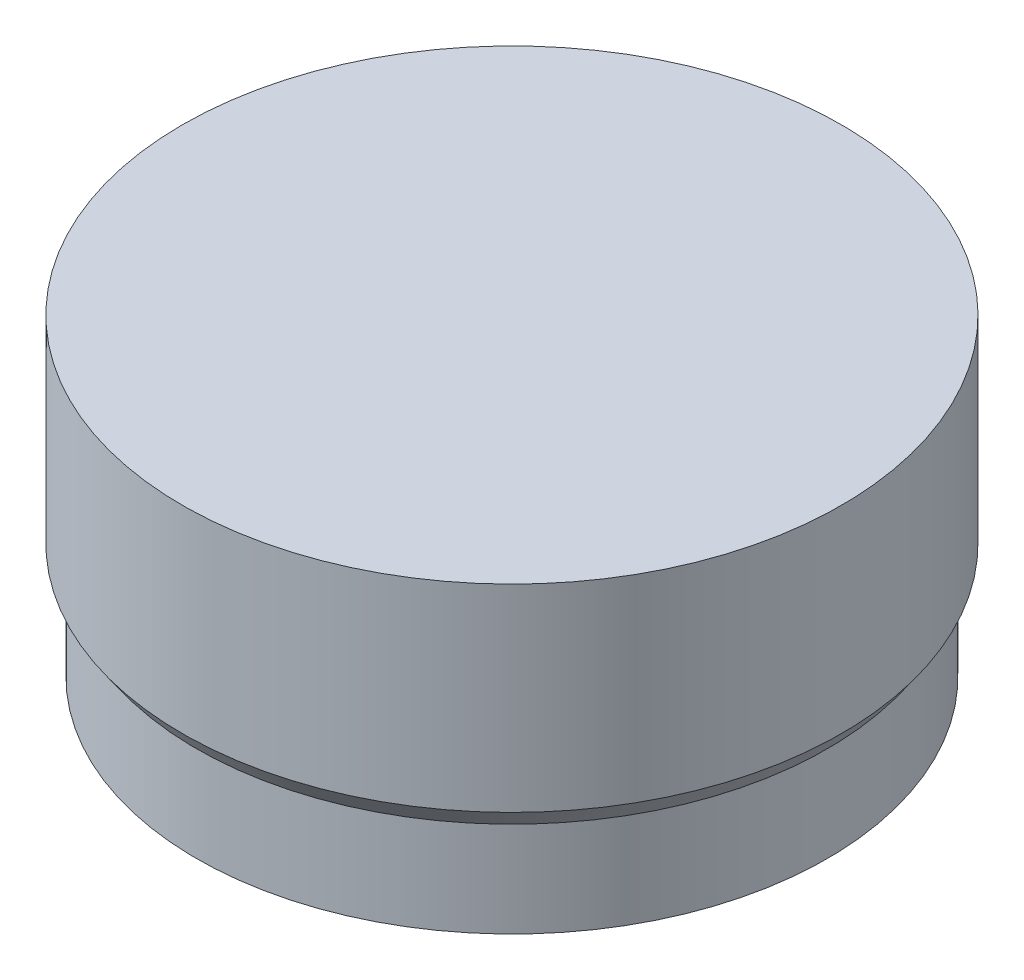
ISO-10303-21;
HEADER;
FILE_DESCRIPTION(('STEP AP214'),'2;1');
FILE_NAME('part.step','',(''),(''),'','','');
FILE_SCHEMA(('AUTOMOTIVE_DESIGN { 1 0 10303 214 1 1 1 1 }'));
ENDSEC;
DATA;
#1=APPLICATION_CONTEXT('core data for automotive mechanical design processes');
#2=APPLICATION_PROTOCOL_DEFINITION('international standard','automotive_design',2000,#1);
#3=PRODUCT_CONTEXT('',#1,'mechanical');
#4=PRODUCT('Part','Part','',(#3));
#5=PRODUCT_RELATED_PRODUCT_CATEGORY('part','',(#4));
#6=PRODUCT_DEFINITION_FORMATION('','',#4);
#7=PRODUCT_DEFINITION_CONTEXT('part definition',#1,'design');
#8=PRODUCT_DEFINITION('design','',#6,#7);
#9=PRODUCT_DEFINITION_SHAPE('','',#8);
#10=(LENGTH_UNIT() NAMED_UNIT(*) SI_UNIT(.MILLI.,.METRE.));
#11=(NAMED_UNIT(*) PLANE_ANGLE_UNIT() SI_UNIT($,.RADIAN.));
#12=(NAMED_UNIT(*) SI_UNIT($,.STERADIAN.) SOLID_ANGLE_UNIT());
#13=UNCERTAINTY_MEASURE_WITH_UNIT(LENGTH_MEASURE(1.E-05),#10,'distance_accuracy_value','');
#14=(GEOMETRIC_REPRESENTATION_CONTEXT(3) GLOBAL_UNCERTAINTY_ASSIGNED_CONTEXT((#13)) GLOBAL_UNIT_ASSIGNED_CONTEXT((#10,
#11,#12)) REPRESENTATION_CONTEXT('',''));
#15=CARTESIAN_POINT('',(0.,0.,0.));
#16=DIRECTION('',(0.,0.,1.));
#17=DIRECTION('',(1.,0.,0.));
#18=AXIS2_PLACEMENT_3D('',#15,#16,#17);
#19=CARTESIAN_POINT('',(-38.2792706909469,29.4190028166561,0.));
#20=DIRECTION('',(0.,1.,0.));
#21=DIRECTION('',(-1.,0.,0.));
#22=AXIS2_PLACEMENT_3D('',#19,#20,#21);
#23=CYLINDRICAL_SURFACE('',#22,38.2792706909469);
#24=CARTESIAN_POINT('',(-38.2792706909469,0.,0.));
#25=DIRECTION('',(0.,1.,0.));
#26=DIRECTION('',(-1.,0.,0.));
#27=AXIS2_PLACEMENT_3D('',#24,#25,#26);
#28=CIRCLE('',#27,38.2792706909469);
#29=CARTESIAN_POINT('',(-76.5585413818937,0.,0.));
#30=VERTEX_POINT('',#29);
#31=EDGE_CURVE('E10',#30,#30,#28,.T.);
#32=ORIENTED_EDGE('',*,*,#31,.F.);
#33=EDGE_LOOP('',(#32));
#34=FACE_BOUND('',#33,.T.);
#35=CARTESIAN_POINT('',(-38.2792706909469,-11.542543867133,0.));
#36=DIRECTION('',(0.,1.,0.));
#37=DIRECTION('',(-1.,0.,0.));
#38=AXIS2_PLACEMENT_3D('',#35,#36,#37);
#39=CIRCLE('',#38,38.2792706909469);
#40=CARTESIAN_POINT('',(-76.5585413818937,-11.542543867133,0.));
#41=VERTEX_POINT('',#40);
#42=EDGE_CURVE('E45',#41,#41,#39,.T.);
#43=ORIENTED_EDGE('',*,*,#42,.T.);
#44=EDGE_LOOP('',(#43));
#45=FACE_BOUND('',#44,.T.);
#46=ADVANCED_FACE('F31',(#34,#45),#23,.T.);
#47=CARTESIAN_POINT('',(-38.2792706909469,0.,0.));
#48=DIRECTION('',(0.,1.,0.));
#49=DIRECTION('',(-1.,0.,0.));
#50=AXIS2_PLACEMENT_3D('',#47,#48,#49);
#51=CONICAL_SURFACE('',#50,38.2792706909469,0.610865238198009);
#52=CARTESIAN_POINT('',(-38.2792706909469,2.45745613286698,0.));
#53=DIRECTION('',(0.,1.,0.));
#54=DIRECTION('',(-1.,0.,0.));
#55=AXIS2_PLACEMENT_3D('',#52,#53,#54);
#56=CIRCLE('',#55,40.);
#57=CARTESIAN_POINT('',(-78.2792706909469,2.45745613286697,0.));
#58=VERTEX_POINT('',#57);
#59=EDGE_CURVE('E37',#58,#58,#56,.T.);
#60=ORIENTED_EDGE('',*,*,#59,.F.);
#61=EDGE_LOOP('',(#60));
#62=FACE_BOUND('',#61,.T.);
#63=ORIENTED_EDGE('',*,*,#31,.T.);
#64=EDGE_LOOP('',(#63));
#65=FACE_BOUND('',#64,.T.);
#66=ADVANCED_FACE('F63',(#62,#65),#51,.T.);
#67=CARTESIAN_POINT('',(-38.2792706909469,29.4190028166561,0.));
#68=DIRECTION('',(0.,1.,0.));
#69=DIRECTION('',(-1.,0.,0.));
#70=AXIS2_PLACEMENT_3D('',#67,#68,#69);
#71=CYLINDRICAL_SURFACE('',#70,40.);
#72=CARTESIAN_POINT('',(-38.2792706909469,26.457456132867,0.));
#73=DIRECTION('',(0.,1.,0.));
#74=DIRECTION('',(-1.,0.,0.));
#75=AXIS2_PLACEMENT_3D('',#72,#73,#74);
#76=CIRCLE('',#75,40.);
#77=CARTESIAN_POINT('',(-78.2792706909469,26.457456132867,0.));
#78=VERTEX_POINT('',#77);
#79=EDGE_CURVE('E41',#78,#78,#76,.T.);
#80=ORIENTED_EDGE('',*,*,#79,.F.);
#81=EDGE_LOOP('',(#80));
#82=FACE_BOUND('',#81,.T.);
#83=ORIENTED_EDGE('',*,*,#59,.T.);
#84=EDGE_LOOP('',(#83));
#85=FACE_BOUND('',#84,.T.);
#86=ADVANCED_FACE('F59',(#82,#85),#71,.T.);
#87=CARTESIAN_POINT('',(-0.679270690946866,26.457456132867,0.));
#88=DIRECTION('',(0.,-1.,0.));
#89=DIRECTION('',(1.,0.,0.));
#90=AXIS2_PLACEMENT_3D('',#87,#88,#89);
#91=PLANE('',#90);
#92=ORIENTED_EDGE('',*,*,#79,.T.);
#93=EDGE_LOOP('',(#92));
#94=FACE_BOUND('',#93,.T.);
#95=ADVANCED_FACE('F54',(#94),#91,.F.);
#96=CARTESIAN_POINT('',(-38.2792706909469,-11.542543867133,0.));
#97=DIRECTION('',(0.,1.,0.));
#98=DIRECTION('',(-1.,0.,0.));
#99=AXIS2_PLACEMENT_3D('',#96,#97,#98);
#100=PLANE('',#99);
#101=ORIENTED_EDGE('',*,*,#42,.F.);
#102=EDGE_LOOP('',(#101));
#103=FACE_BOUND('',#102,.T.);
#104=ADVANCED_FACE('F52',(#103),#100,.F.);
#105=CLOSED_SHELL('',(#46,#66,#86,#95,#104));
#106=MANIFOLD_SOLID_BREP('B2',#105);
#107=ADVANCED_BREP_SHAPE_REPRESENTATION('',(#18,#106),#14);
#108=SHAPE_DEFINITION_REPRESENTATION(#9,#107);
ENDSEC;
END-ISO-10303-21;
